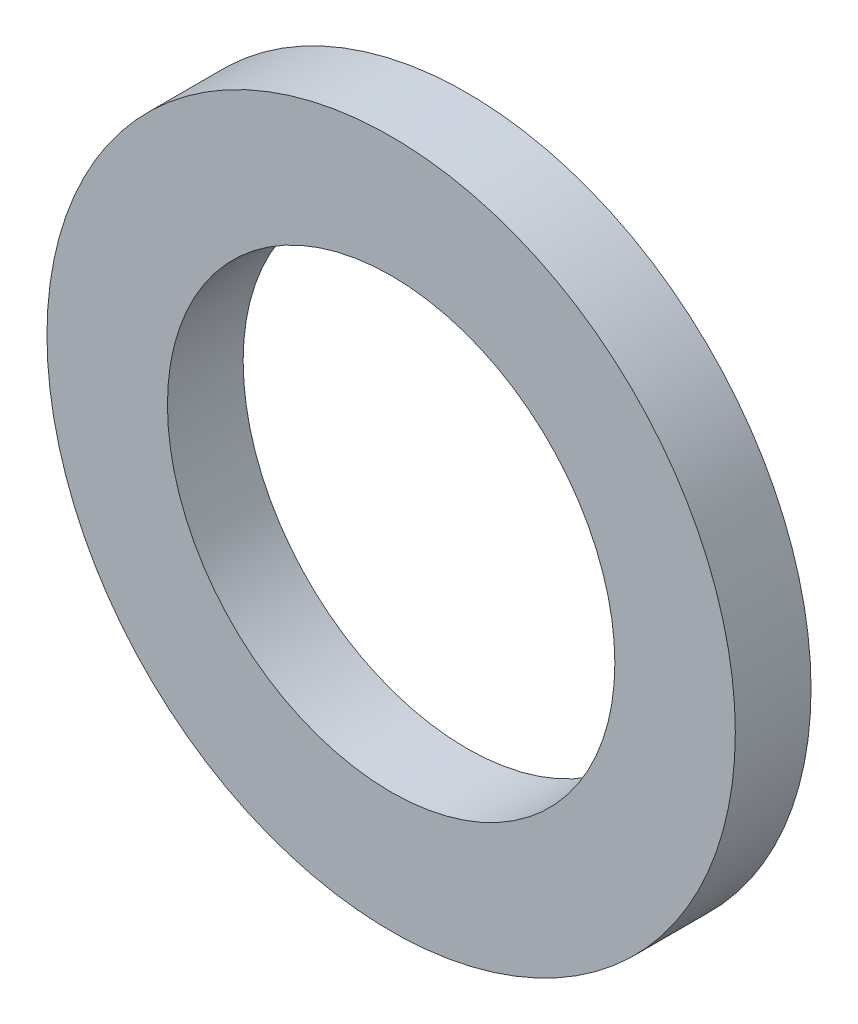
ISO-10303-21;
HEADER;
FILE_DESCRIPTION(('STEP AP214'),'2;1');
FILE_NAME('part.step','',(''),(''),'','','');
FILE_SCHEMA(('AUTOMOTIVE_DESIGN { 1 0 10303 214 1 1 1 1 }'));
ENDSEC;
DATA;
#1=APPLICATION_CONTEXT('core data for automotive mechanical design processes');
#2=APPLICATION_PROTOCOL_DEFINITION('international standard','automotive_design',2000,#1);
#3=PRODUCT_CONTEXT('',#1,'mechanical');
#4=PRODUCT('Part','Part','',(#3));
#5=PRODUCT_RELATED_PRODUCT_CATEGORY('part','',(#4));
#6=PRODUCT_DEFINITION_FORMATION('','',#4);
#7=PRODUCT_DEFINITION_CONTEXT('part definition',#1,'design');
#8=PRODUCT_DEFINITION('design','',#6,#7);
#9=PRODUCT_DEFINITION_SHAPE('','',#8);
#10=(LENGTH_UNIT() NAMED_UNIT(*) SI_UNIT(.MILLI.,.METRE.));
#11=(NAMED_UNIT(*) PLANE_ANGLE_UNIT() SI_UNIT($,.RADIAN.));
#12=(NAMED_UNIT(*) SI_UNIT($,.STERADIAN.) SOLID_ANGLE_UNIT());
#13=UNCERTAINTY_MEASURE_WITH_UNIT(LENGTH_MEASURE(1.E-05),#10,'distance_accuracy_value','');
#14=(GEOMETRIC_REPRESENTATION_CONTEXT(3) GLOBAL_UNCERTAINTY_ASSIGNED_CONTEXT((#13)) GLOBAL_UNIT_ASSIGNED_CONTEXT((#10,
#11,#12)) REPRESENTATION_CONTEXT('',''));
#15=CARTESIAN_POINT('',(0.,0.,0.));
#16=DIRECTION('',(0.,0.,1.));
#17=DIRECTION('',(1.,0.,0.));
#18=AXIS2_PLACEMENT_3D('',#15,#16,#17);
#19=CARTESIAN_POINT('',(0.,0.,2.2));
#20=DIRECTION('',(0.,0.,1.));
#21=DIRECTION('',(1.,0.,0.));
#22=AXIS2_PLACEMENT_3D('',#19,#20,#21);
#23=PLANE('',#22);
#24=CARTESIAN_POINT('',(0.,0.,2.2));
#25=DIRECTION('',(0.,0.,1.));
#26=DIRECTION('',(1.,0.,0.));
#27=AXIS2_PLACEMENT_3D('',#24,#25,#26);
#28=CIRCLE('',#27,10.);
#29=CARTESIAN_POINT('',(10.,0.,2.2));
#30=VERTEX_POINT('',#29);
#31=EDGE_CURVE('E10',#30,#30,#28,.T.);
#32=ORIENTED_EDGE('',*,*,#31,.T.);
#33=EDGE_LOOP('',(#32));
#34=FACE_BOUND('',#33,.T.);
#35=CARTESIAN_POINT('',(0.,0.,2.2));
#36=DIRECTION('',(0.,0.,1.));
#37=DIRECTION('',(1.,0.,0.));
#38=AXIS2_PLACEMENT_3D('',#35,#36,#37);
#39=CIRCLE('',#38,6.5);
#40=CARTESIAN_POINT('',(6.5,0.,2.2));
#41=VERTEX_POINT('',#40);
#42=EDGE_CURVE('E43',#41,#41,#39,.T.);
#43=ORIENTED_EDGE('',*,*,#42,.F.);
#44=EDGE_LOOP('',(#43));
#45=FACE_BOUND('',#44,.T.);
#46=ADVANCED_FACE('F32',(#34,#45),#23,.T.);
#47=CARTESIAN_POINT('',(0.,0.,0.));
#48=DIRECTION('',(0.,0.,1.));
#49=DIRECTION('',(1.,0.,0.));
#50=AXIS2_PLACEMENT_3D('',#47,#48,#49);
#51=PLANE('',#50);
#52=CARTESIAN_POINT('',(0.,0.,0.));
#53=DIRECTION('',(0.,0.,1.));
#54=DIRECTION('',(1.,0.,0.));
#55=AXIS2_PLACEMENT_3D('',#52,#53,#54);
#56=CIRCLE('',#55,10.);
#57=CARTESIAN_POINT('',(10.,0.,0.));
#58=VERTEX_POINT('',#57);
#59=EDGE_CURVE('E36',#58,#58,#56,.T.);
#60=ORIENTED_EDGE('',*,*,#59,.F.);
#61=EDGE_LOOP('',(#60));
#62=FACE_BOUND('',#61,.T.);
#63=CARTESIAN_POINT('',(0.,0.,0.));
#64=DIRECTION('',(0.,0.,1.));
#65=DIRECTION('',(1.,0.,0.));
#66=AXIS2_PLACEMENT_3D('',#63,#64,#65);
#67=CIRCLE('',#66,6.5);
#68=CARTESIAN_POINT('',(6.5,0.,0.));
#69=VERTEX_POINT('',#68);
#70=EDGE_CURVE('E45',#69,#69,#67,.T.);
#71=ORIENTED_EDGE('',*,*,#70,.T.);
#72=EDGE_LOOP('',(#71));
#73=FACE_BOUND('',#72,.T.);
#74=ADVANCED_FACE('F55',(#62,#73),#51,.F.);
#75=CARTESIAN_POINT('',(0.,0.,2.2));
#76=DIRECTION('',(0.,0.,-1.));
#77=DIRECTION('',(-1.,0.,0.));
#78=AXIS2_PLACEMENT_3D('',#75,#76,#77);
#79=CYLINDRICAL_SURFACE('',#78,10.);
#80=ORIENTED_EDGE('',*,*,#31,.F.);
#81=EDGE_LOOP('',(#80));
#82=FACE_BOUND('',#81,.T.);
#83=ORIENTED_EDGE('',*,*,#59,.T.);
#84=EDGE_LOOP('',(#83));
#85=FACE_BOUND('',#84,.T.);
#86=ADVANCED_FACE('F34',(#82,#85),#79,.T.);
#87=CARTESIAN_POINT('',(0.,0.,2.2));
#88=DIRECTION('',(0.,0.,-1.));
#89=DIRECTION('',(-1.,0.,0.));
#90=AXIS2_PLACEMENT_3D('',#87,#88,#89);
#91=CYLINDRICAL_SURFACE('',#90,6.5);
#92=ORIENTED_EDGE('',*,*,#42,.T.);
#93=EDGE_LOOP('',(#92));
#94=FACE_BOUND('',#93,.T.);
#95=ORIENTED_EDGE('',*,*,#70,.F.);
#96=EDGE_LOOP('',(#95));
#97=FACE_BOUND('',#96,.T.);
#98=ADVANCED_FACE('F51',(#94,#97),#91,.F.);
#99=CLOSED_SHELL('',(#46,#74,#86,#98));
#100=MANIFOLD_SOLID_BREP('B2',#99);
#101=ADVANCED_BREP_SHAPE_REPRESENTATION('',(#18,#100),#14);
#102=SHAPE_DEFINITION_REPRESENTATION(#9,#101);
ENDSEC;
END-ISO-10303-21;
